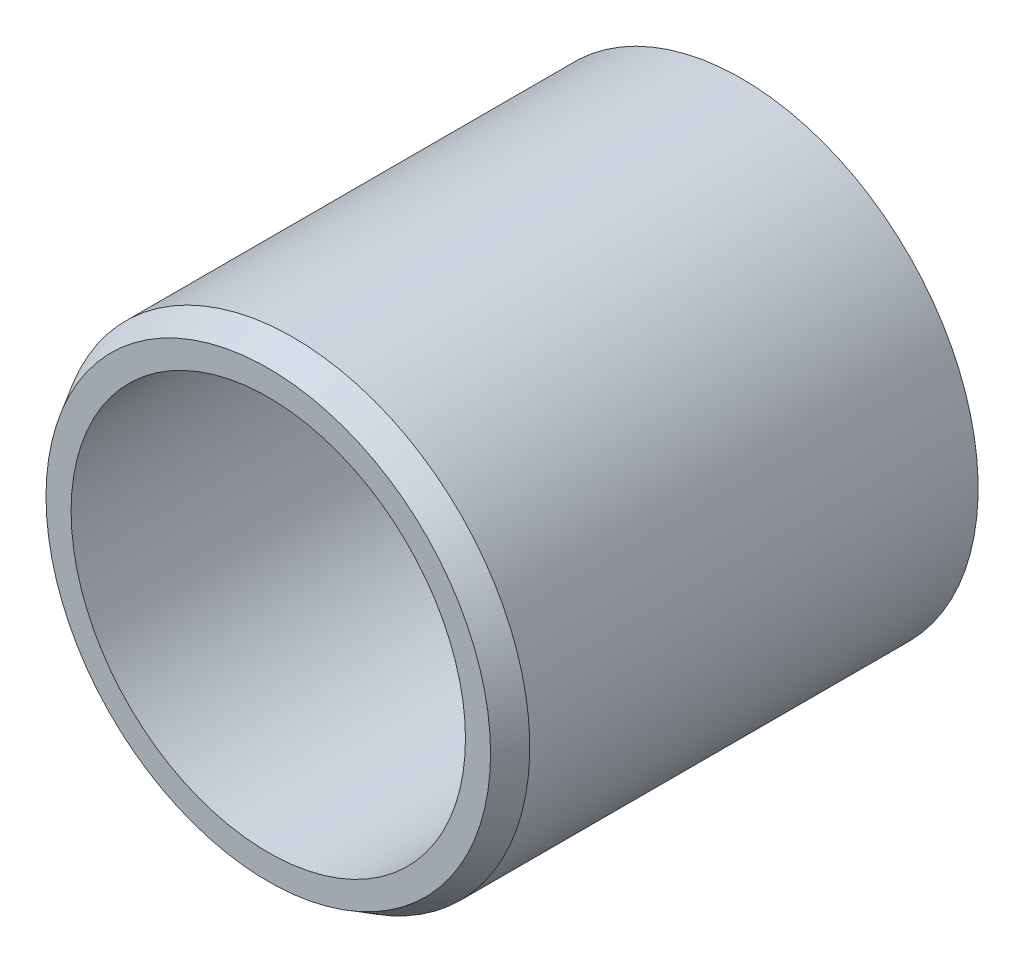
ISO-10303-21;
HEADER;
FILE_DESCRIPTION(('STEP AP214'),'2;1');
FILE_NAME('part.step','',(''),(''),'','','');
FILE_SCHEMA(('AUTOMOTIVE_DESIGN { 1 0 10303 214 1 1 1 1 }'));
ENDSEC;
DATA;
#1=APPLICATION_CONTEXT('core data for automotive mechanical design processes');
#2=APPLICATION_PROTOCOL_DEFINITION('international standard','automotive_design',2000,#1);
#3=PRODUCT_CONTEXT('',#1,'mechanical');
#4=PRODUCT('Part','Part','',(#3));
#5=PRODUCT_RELATED_PRODUCT_CATEGORY('part','',(#4));
#6=PRODUCT_DEFINITION_FORMATION('','',#4);
#7=PRODUCT_DEFINITION_CONTEXT('part definition',#1,'design');
#8=PRODUCT_DEFINITION('design','',#6,#7);
#9=PRODUCT_DEFINITION_SHAPE('','',#8);
#10=(LENGTH_UNIT() NAMED_UNIT(*) SI_UNIT(.MILLI.,.METRE.));
#11=(NAMED_UNIT(*) PLANE_ANGLE_UNIT() SI_UNIT($,.RADIAN.));
#12=(NAMED_UNIT(*) SI_UNIT($,.STERADIAN.) SOLID_ANGLE_UNIT());
#13=UNCERTAINTY_MEASURE_WITH_UNIT(LENGTH_MEASURE(1.E-05),#10,'distance_accuracy_value','');
#14=(GEOMETRIC_REPRESENTATION_CONTEXT(3) GLOBAL_UNCERTAINTY_ASSIGNED_CONTEXT((#13)) GLOBAL_UNIT_ASSIGNED_CONTEXT((#10,
#11,#12)) REPRESENTATION_CONTEXT('',''));
#15=CARTESIAN_POINT('',(0.,0.,0.));
#16=DIRECTION('',(0.,0.,1.));
#17=DIRECTION('',(1.,0.,0.));
#18=AXIS2_PLACEMENT_3D('',#15,#16,#17);
#19=CARTESIAN_POINT('',(0.,0.,9.0249999999516));
#20=DIRECTION('',(0.,0.,-1.));
#21=DIRECTION('',(-1.,0.,0.));
#22=AXIS2_PLACEMENT_3D('',#19,#20,#21);
#23=CONICAL_SURFACE('',#22,4.7625000000388,0.523598775598298);
#24=CARTESIAN_POINT('',(0.,0.,9.525));
#25=DIRECTION('',(0.,0.,-1.));
#26=DIRECTION('',(-1.,0.,0.));
#27=AXIS2_PLACEMENT_3D('',#24,#25,#26);
#28=CIRCLE('',#27,4.47382486541604);
#29=CARTESIAN_POINT('',(-4.47382486541604,0.,9.525));
#30=VERTEX_POINT('',#29);
#31=EDGE_CURVE('E10',#30,#30,#28,.T.);
#32=ORIENTED_EDGE('',*,*,#31,.T.);
#33=EDGE_LOOP('',(#32));
#34=FACE_BOUND('',#33,.T.);
#35=CARTESIAN_POINT('',(0.,0.,9.0249999999516));
#36=DIRECTION('',(0.,0.,-1.));
#37=DIRECTION('',(-1.,0.,0.));
#38=AXIS2_PLACEMENT_3D('',#35,#36,#37);
#39=CIRCLE('',#38,4.7625000000388);
#40=CARTESIAN_POINT('',(-4.7625000000388,0.,9.0249999999516));
#41=VERTEX_POINT('',#40);
#42=EDGE_CURVE('E55',#41,#41,#39,.T.);
#43=ORIENTED_EDGE('',*,*,#42,.F.);
#44=EDGE_LOOP('',(#43));
#45=FACE_BOUND('',#44,.T.);
#46=ADVANCED_FACE('F33',(#34,#45),#23,.T.);
#47=CARTESIAN_POINT('',(4.47382486541604,0.,9.525));
#48=DIRECTION('',(0.,0.,1.));
#49=DIRECTION('',(1.,0.,0.));
#50=AXIS2_PLACEMENT_3D('',#47,#48,#49);
#51=PLANE('',#50);
#52=CARTESIAN_POINT('',(0.,0.,9.525));
#53=DIRECTION('',(0.,0.,-1.));
#54=DIRECTION('',(-1.,0.,0.));
#55=AXIS2_PLACEMENT_3D('',#52,#53,#54);
#56=CIRCLE('',#55,3.96875000003032);
#57=CARTESIAN_POINT('',(-3.96875000003032,0.,9.525));
#58=VERTEX_POINT('',#57);
#59=EDGE_CURVE('E39',#58,#58,#56,.T.);
#60=ORIENTED_EDGE('',*,*,#59,.T.);
#61=EDGE_LOOP('',(#60));
#62=FACE_BOUND('',#61,.T.);
#63=ORIENTED_EDGE('',*,*,#31,.F.);
#64=EDGE_LOOP('',(#63));
#65=FACE_BOUND('',#64,.T.);
#66=ADVANCED_FACE('F63',(#62,#65),#51,.T.);
#67=CARTESIAN_POINT('',(0.,0.,9.5250000000533));
#68=DIRECTION('',(0.,0.,-1.));
#69=DIRECTION('',(-1.,0.,0.));
#70=AXIS2_PLACEMENT_3D('',#67,#68,#69);
#71=CYLINDRICAL_SURFACE('',#70,3.96875000003032);
#72=CARTESIAN_POINT('',(0.,0.,0.499999999988177));
#73=DIRECTION('',(0.,0.,-1.));
#74=DIRECTION('',(-1.,0.,0.));
#75=AXIS2_PLACEMENT_3D('',#72,#73,#74);
#76=CIRCLE('',#75,3.96875000003032);
#77=CARTESIAN_POINT('',(-3.96875000003032,0.,0.499999999988177));
#78=VERTEX_POINT('',#77);
#79=EDGE_CURVE('E43',#78,#78,#76,.T.);
#80=ORIENTED_EDGE('',*,*,#79,.T.);
#81=EDGE_LOOP('',(#80));
#82=FACE_BOUND('',#81,.T.);
#83=ORIENTED_EDGE('',*,*,#59,.F.);
#84=EDGE_LOOP('',(#83));
#85=FACE_BOUND('',#84,.T.);
#86=ADVANCED_FACE('F67',(#82,#85),#71,.F.);
#87=CARTESIAN_POINT('',(0.,0.,0.499999999988177));
#88=DIRECTION('',(0.,0.,-1.));
#89=DIRECTION('',(-1.,0.,0.));
#90=AXIS2_PLACEMENT_3D('',#87,#88,#89);
#91=CONICAL_SURFACE('',#90,3.96875000003032,0.523598775598298);
#92=CARTESIAN_POINT('',(0.,0.,1.68962066560141E-12));
#93=DIRECTION('',(0.,0.,-1.));
#94=DIRECTION('',(-1.,0.,0.));
#95=AXIS2_PLACEMENT_3D('',#92,#93,#94);
#96=CIRCLE('',#95,4.25742513461733);
#97=CARTESIAN_POINT('',(-4.25742513461733,0.,1.68962066560141E-12));
#98=VERTEX_POINT('',#97);
#99=EDGE_CURVE('E47',#98,#98,#96,.T.);
#100=ORIENTED_EDGE('',*,*,#99,.T.);
#101=EDGE_LOOP('',(#100));
#102=FACE_BOUND('',#101,.T.);
#103=ORIENTED_EDGE('',*,*,#79,.F.);
#104=EDGE_LOOP('',(#103));
#105=FACE_BOUND('',#104,.T.);
#106=ADVANCED_FACE('F71',(#102,#105),#91,.F.);
#107=CARTESIAN_POINT('',(4.25742513461733,0.,1.6904880273394E-12));
#108=DIRECTION('',(0.,0.,-1.));
#109=DIRECTION('',(-1.,0.,0.));
#110=AXIS2_PLACEMENT_3D('',#107,#108,#109);
#111=PLANE('',#110);
#112=CARTESIAN_POINT('',(0.,0.,1.68962066560141E-12));
#113=DIRECTION('',(0.,0.,-1.));
#114=DIRECTION('',(-1.,0.,0.));
#115=AXIS2_PLACEMENT_3D('',#112,#113,#114);
#116=CIRCLE('',#115,4.7625000000388);
#117=CARTESIAN_POINT('',(-4.7625000000388,0.,1.68962066560141E-12));
#118=VERTEX_POINT('',#117);
#119=EDGE_CURVE('E52',#118,#118,#116,.T.);
#120=ORIENTED_EDGE('',*,*,#119,.T.);
#121=EDGE_LOOP('',(#120));
#122=FACE_BOUND('',#121,.T.);
#123=ORIENTED_EDGE('',*,*,#99,.F.);
#124=EDGE_LOOP('',(#123));
#125=FACE_BOUND('',#124,.T.);
#126=ADVANCED_FACE('F78',(#122,#125),#111,.T.);
#127=CARTESIAN_POINT('',(0.,0.,9.5250000000533));
#128=DIRECTION('',(0.,0.,-1.));
#129=DIRECTION('',(-1.,0.,0.));
#130=AXIS2_PLACEMENT_3D('',#127,#128,#129);
#131=CYLINDRICAL_SURFACE('',#130,4.7625000000388);
#132=ORIENTED_EDGE('',*,*,#42,.T.);
#133=EDGE_LOOP('',(#132));
#134=FACE_BOUND('',#133,.T.);
#135=ORIENTED_EDGE('',*,*,#119,.F.);
#136=EDGE_LOOP('',(#135));
#137=FACE_BOUND('',#136,.T.);
#138=ADVANCED_FACE('F59',(#134,#137),#131,.T.);
#139=CLOSED_SHELL('',(#46,#66,#86,#106,#126,#138));
#140=MANIFOLD_SOLID_BREP('B2',#139);
#141=ADVANCED_BREP_SHAPE_REPRESENTATION('',(#18,#140),#14);
#142=SHAPE_DEFINITION_REPRESENTATION(#9,#141);
ENDSEC;
END-ISO-10303-21;
